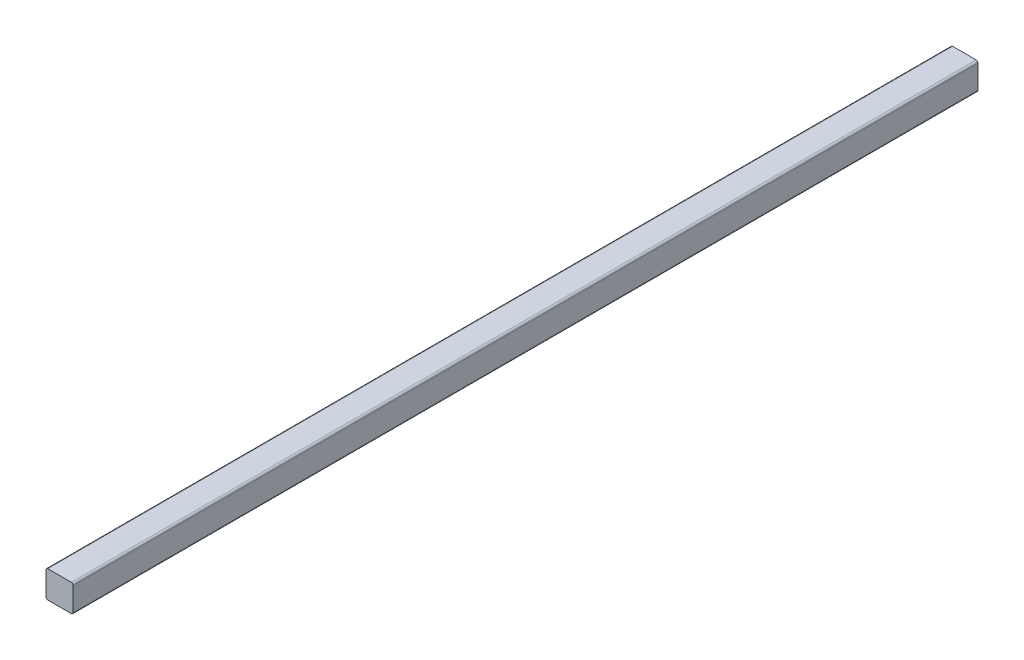
ISO-10303-21;
HEADER;
FILE_DESCRIPTION(('STEP AP214'),'2;1');
FILE_NAME('part.step','',(''),(''),'','','');
FILE_SCHEMA(('AUTOMOTIVE_DESIGN { 1 0 10303 214 1 1 1 1 }'));
ENDSEC;
DATA;
#1=APPLICATION_CONTEXT('core data for automotive mechanical design processes');
#2=APPLICATION_PROTOCOL_DEFINITION('international standard','automotive_design',2000,#1);
#3=PRODUCT_CONTEXT('',#1,'mechanical');
#4=PRODUCT('Part','Part','',(#3));
#5=PRODUCT_RELATED_PRODUCT_CATEGORY('part','',(#4));
#6=PRODUCT_DEFINITION_FORMATION('','',#4);
#7=PRODUCT_DEFINITION_CONTEXT('part definition',#1,'design');
#8=PRODUCT_DEFINITION('design','',#6,#7);
#9=PRODUCT_DEFINITION_SHAPE('','',#8);
#10=(LENGTH_UNIT() NAMED_UNIT(*) SI_UNIT(.MILLI.,.METRE.));
#11=(NAMED_UNIT(*) PLANE_ANGLE_UNIT() SI_UNIT($,.RADIAN.));
#12=(NAMED_UNIT(*) SI_UNIT($,.STERADIAN.) SOLID_ANGLE_UNIT());
#13=UNCERTAINTY_MEASURE_WITH_UNIT(LENGTH_MEASURE(1.E-05),#10,'distance_accuracy_value','');
#14=(GEOMETRIC_REPRESENTATION_CONTEXT(3) GLOBAL_UNCERTAINTY_ASSIGNED_CONTEXT((#13)) GLOBAL_UNIT_ASSIGNED_CONTEXT((#10,
#11,#12)) REPRESENTATION_CONTEXT('',''));
#15=CARTESIAN_POINT('',(0.,0.,0.));
#16=DIRECTION('',(0.,0.,1.));
#17=DIRECTION('',(1.,0.,0.));
#18=AXIS2_PLACEMENT_3D('',#15,#16,#17);
#19=CARTESIAN_POINT('',(2.,2.,1000.));
#20=DIRECTION('',(0.,0.,-1.));
#21=DIRECTION('',(-1.,0.,0.));
#22=AXIS2_PLACEMENT_3D('',#19,#20,#21);
#23=CYLINDRICAL_SURFACE('',#22,2.);
#24=CARTESIAN_POINT('',(2.,2.,0.));
#25=DIRECTION('',(0.,0.,1.));
#26=DIRECTION('',(-1.,0.,0.));
#27=AXIS2_PLACEMENT_3D('',#24,#25,#26);
#28=CIRCLE('',#27,2.);
#29=CARTESIAN_POINT('',(0.,2.00000000000001,0.));
#30=VERTEX_POINT('',#29);
#31=CARTESIAN_POINT('',(2.00000000000001,0.,0.));
#32=VERTEX_POINT('',#31);
#33=EDGE_CURVE('E129',#30,#32,#28,.T.);
#34=ORIENTED_EDGE('',*,*,#33,.T.);
#35=DIRECTION('',(0.,0.,-1.));
#36=VECTOR('',#35,1.);
#37=CARTESIAN_POINT('',(2.00000000000001,0.,1000.));
#38=LINE('',#37,#36);
#39=CARTESIAN_POINT('',(2.00000000000001,0.,1000.));
#40=VERTEX_POINT('',#39);
#41=EDGE_CURVE('E11',#40,#32,#38,.T.);
#42=ORIENTED_EDGE('',*,*,#41,.F.);
#43=CARTESIAN_POINT('',(2.,2.,1000.));
#44=DIRECTION('',(0.,0.,1.));
#45=DIRECTION('',(-1.,0.,0.));
#46=AXIS2_PLACEMENT_3D('',#43,#44,#45);
#47=CIRCLE('',#46,2.);
#48=CARTESIAN_POINT('',(0.,2.00000000000001,1000.));
#49=VERTEX_POINT('',#48);
#50=EDGE_CURVE('E143',#49,#40,#47,.T.);
#51=ORIENTED_EDGE('',*,*,#50,.F.);
#52=DIRECTION('',(0.,0.,-1.));
#53=VECTOR('',#52,1.);
#54=CARTESIAN_POINT('',(0.,2.00000000000001,1000.));
#55=LINE('',#54,#53);
#56=EDGE_CURVE('E125',#49,#30,#55,.T.);
#57=ORIENTED_EDGE('',*,*,#56,.T.);
#58=EDGE_LOOP('',(#34,#42,#51,#57));
#59=FACE_BOUND('',#58,.T.);
#60=ADVANCED_FACE('F33',(#59),#23,.T.);
#61=CARTESIAN_POINT('',(2.00000000000001,0.,1000.));
#62=DIRECTION('',(0.,1.,0.));
#63=DIRECTION('',(0.,0.,1.));
#64=AXIS2_PLACEMENT_3D('',#61,#62,#63);
#65=PLANE('',#64);
#66=DIRECTION('',(1.,0.,0.));
#67=VECTOR('',#66,1.);
#68=CARTESIAN_POINT('',(2.00000000000001,0.,0.));
#69=LINE('',#68,#67);
#70=CARTESIAN_POINT('',(28.,0.,0.));
#71=VERTEX_POINT('',#70);
#72=EDGE_CURVE('E132',#32,#71,#69,.T.);
#73=ORIENTED_EDGE('',*,*,#72,.T.);
#74=DIRECTION('',(0.,0.,-1.));
#75=VECTOR('',#74,1.);
#76=CARTESIAN_POINT('',(28.,0.,1000.));
#77=LINE('',#76,#75);
#78=CARTESIAN_POINT('',(28.,0.,1000.));
#79=VERTEX_POINT('',#78);
#80=EDGE_CURVE('E41',#79,#71,#77,.T.);
#81=ORIENTED_EDGE('',*,*,#80,.F.);
#82=DIRECTION('',(1.,0.,0.));
#83=VECTOR('',#82,1.);
#84=CARTESIAN_POINT('',(2.00000000000001,0.,1000.));
#85=LINE('',#84,#83);
#86=EDGE_CURVE('E92',#40,#79,#85,.T.);
#87=ORIENTED_EDGE('',*,*,#86,.F.);
#88=ORIENTED_EDGE('',*,*,#41,.T.);
#89=EDGE_LOOP('',(#73,#81,#87,#88));
#90=FACE_BOUND('',#89,.T.);
#91=ADVANCED_FACE('F178',(#90),#65,.F.);
#92=CARTESIAN_POINT('',(28.,2.,1000.));
#93=DIRECTION('',(0.,0.,-1.));
#94=DIRECTION('',(-1.,0.,0.));
#95=AXIS2_PLACEMENT_3D('',#92,#93,#94);
#96=CYLINDRICAL_SURFACE('',#95,2.);
#97=CARTESIAN_POINT('',(28.,2.,0.));
#98=DIRECTION('',(0.,0.,1.));
#99=DIRECTION('',(-1.,0.,0.));
#100=AXIS2_PLACEMENT_3D('',#97,#98,#99);
#101=CIRCLE('',#100,2.);
#102=CARTESIAN_POINT('',(30.,2.00000000000001,0.));
#103=VERTEX_POINT('',#102);
#104=EDGE_CURVE('E134',#71,#103,#101,.T.);
#105=ORIENTED_EDGE('',*,*,#104,.T.);
#106=DIRECTION('',(0.,0.,-1.));
#107=VECTOR('',#106,1.);
#108=CARTESIAN_POINT('',(30.,2.00000000000001,1000.));
#109=LINE('',#108,#107);
#110=CARTESIAN_POINT('',(30.,2.00000000000001,1000.));
#111=VERTEX_POINT('',#110);
#112=EDGE_CURVE('E150',#111,#103,#109,.T.);
#113=ORIENTED_EDGE('',*,*,#112,.F.);
#114=CARTESIAN_POINT('',(28.,2.,1000.));
#115=DIRECTION('',(0.,0.,1.));
#116=DIRECTION('',(-1.,0.,0.));
#117=AXIS2_PLACEMENT_3D('',#114,#115,#116);
#118=CIRCLE('',#117,2.);
#119=EDGE_CURVE('E158',#79,#111,#118,.T.);
#120=ORIENTED_EDGE('',*,*,#119,.F.);
#121=ORIENTED_EDGE('',*,*,#80,.T.);
#122=EDGE_LOOP('',(#105,#113,#120,#121));
#123=FACE_BOUND('',#122,.T.);
#124=ADVANCED_FACE('F156',(#123),#96,.T.);
#125=CARTESIAN_POINT('',(30.,2.00000000000001,1000.));
#126=DIRECTION('',(-1.,0.,0.));
#127=DIRECTION('',(0.,0.,1.));
#128=AXIS2_PLACEMENT_3D('',#125,#126,#127);
#129=PLANE('',#128);
#130=DIRECTION('',(0.,1.,0.));
#131=VECTOR('',#130,1.);
#132=CARTESIAN_POINT('',(30.,2.00000000000001,0.));
#133=LINE('',#132,#131);
#134=CARTESIAN_POINT('',(30.,28.,0.));
#135=VERTEX_POINT('',#134);
#136=EDGE_CURVE('E136',#103,#135,#133,.T.);
#137=ORIENTED_EDGE('',*,*,#136,.T.);
#138=DIRECTION('',(0.,0.,-1.));
#139=VECTOR('',#138,1.);
#140=CARTESIAN_POINT('',(30.,28.,1000.));
#141=LINE('',#140,#139);
#142=CARTESIAN_POINT('',(30.,28.,1000.));
#143=VERTEX_POINT('',#142);
#144=EDGE_CURVE('E147',#143,#135,#141,.T.);
#145=ORIENTED_EDGE('',*,*,#144,.F.);
#146=DIRECTION('',(0.,1.,0.));
#147=VECTOR('',#146,1.);
#148=CARTESIAN_POINT('',(30.,2.00000000000001,1000.));
#149=LINE('',#148,#147);
#150=EDGE_CURVE('E170',#111,#143,#149,.T.);
#151=ORIENTED_EDGE('',*,*,#150,.F.);
#152=ORIENTED_EDGE('',*,*,#112,.T.);
#153=EDGE_LOOP('',(#137,#145,#151,#152));
#154=FACE_BOUND('',#153,.T.);
#155=ADVANCED_FACE('F166',(#154),#129,.F.);
#156=CARTESIAN_POINT('',(28.,28.,1000.));
#157=DIRECTION('',(0.,0.,-1.));
#158=DIRECTION('',(-1.,0.,0.));
#159=AXIS2_PLACEMENT_3D('',#156,#157,#158);
#160=CYLINDRICAL_SURFACE('',#159,2.);
#161=CARTESIAN_POINT('',(28.,28.,0.));
#162=DIRECTION('',(0.,0.,1.));
#163=DIRECTION('',(-1.,0.,0.));
#164=AXIS2_PLACEMENT_3D('',#161,#162,#163);
#165=CIRCLE('',#164,2.);
#166=CARTESIAN_POINT('',(28.,30.,0.));
#167=VERTEX_POINT('',#166);
#168=EDGE_CURVE('E138',#135,#167,#165,.T.);
#169=ORIENTED_EDGE('',*,*,#168,.T.);
#170=DIRECTION('',(0.,0.,-1.));
#171=VECTOR('',#170,1.);
#172=CARTESIAN_POINT('',(28.,30.,1000.));
#173=LINE('',#172,#171);
#174=CARTESIAN_POINT('',(28.,30.,1000.));
#175=VERTEX_POINT('',#174);
#176=EDGE_CURVE('E120',#175,#167,#173,.T.);
#177=ORIENTED_EDGE('',*,*,#176,.F.);
#178=CARTESIAN_POINT('',(28.,28.,1000.));
#179=DIRECTION('',(0.,0.,1.));
#180=DIRECTION('',(-1.,0.,0.));
#181=AXIS2_PLACEMENT_3D('',#178,#179,#180);
#182=CIRCLE('',#181,2.);
#183=EDGE_CURVE('E111',#143,#175,#182,.T.);
#184=ORIENTED_EDGE('',*,*,#183,.F.);
#185=ORIENTED_EDGE('',*,*,#144,.T.);
#186=EDGE_LOOP('',(#169,#177,#184,#185));
#187=FACE_BOUND('',#186,.T.);
#188=ADVANCED_FACE('F169',(#187),#160,.T.);
#189=CARTESIAN_POINT('',(28.,30.,1000.));
#190=DIRECTION('',(0.,-1.,0.));
#191=DIRECTION('',(0.,0.,-1.));
#192=AXIS2_PLACEMENT_3D('',#189,#190,#191);
#193=PLANE('',#192);
#194=DIRECTION('',(-1.,0.,0.));
#195=VECTOR('',#194,1.);
#196=CARTESIAN_POINT('',(28.,30.,0.));
#197=LINE('',#196,#195);
#198=CARTESIAN_POINT('',(2.00000000000001,30.,0.));
#199=VERTEX_POINT('',#198);
#200=EDGE_CURVE('E119',#167,#199,#197,.T.);
#201=ORIENTED_EDGE('',*,*,#200,.T.);
#202=DIRECTION('',(0.,0.,-1.));
#203=VECTOR('',#202,1.);
#204=CARTESIAN_POINT('',(2.00000000000001,30.,1000.));
#205=LINE('',#204,#203);
#206=CARTESIAN_POINT('',(2.00000000000001,30.,1000.));
#207=VERTEX_POINT('',#206);
#208=EDGE_CURVE('E116',#207,#199,#205,.T.);
#209=ORIENTED_EDGE('',*,*,#208,.F.);
#210=DIRECTION('',(-1.,0.,0.));
#211=VECTOR('',#210,1.);
#212=CARTESIAN_POINT('',(28.,30.,1000.));
#213=LINE('',#212,#211);
#214=EDGE_CURVE('E105',#175,#207,#213,.T.);
#215=ORIENTED_EDGE('',*,*,#214,.F.);
#216=ORIENTED_EDGE('',*,*,#176,.T.);
#217=EDGE_LOOP('',(#201,#209,#215,#216));
#218=FACE_BOUND('',#217,.T.);
#219=ADVANCED_FACE('F117',(#218),#193,.F.);
#220=CARTESIAN_POINT('',(2.,28.,1000.));
#221=DIRECTION('',(0.,0.,-1.));
#222=DIRECTION('',(-1.,0.,0.));
#223=AXIS2_PLACEMENT_3D('',#220,#221,#222);
#224=CYLINDRICAL_SURFACE('',#223,2.);
#225=CARTESIAN_POINT('',(2.,28.,0.));
#226=DIRECTION('',(0.,0.,1.));
#227=DIRECTION('',(-1.,0.,0.));
#228=AXIS2_PLACEMENT_3D('',#225,#226,#227);
#229=CIRCLE('',#228,2.);
#230=CARTESIAN_POINT('',(0.,28.,0.));
#231=VERTEX_POINT('',#230);
#232=EDGE_CURVE('E78',#199,#231,#229,.T.);
#233=ORIENTED_EDGE('',*,*,#232,.T.);
#234=DIRECTION('',(0.,0.,-1.));
#235=VECTOR('',#234,1.);
#236=CARTESIAN_POINT('',(0.,28.,1000.));
#237=LINE('',#236,#235);
#238=CARTESIAN_POINT('',(0.,28.,1000.));
#239=VERTEX_POINT('',#238);
#240=EDGE_CURVE('E121',#239,#231,#237,.T.);
#241=ORIENTED_EDGE('',*,*,#240,.F.);
#242=CARTESIAN_POINT('',(2.,28.,1000.));
#243=DIRECTION('',(0.,0.,1.));
#244=DIRECTION('',(-1.,0.,0.));
#245=AXIS2_PLACEMENT_3D('',#242,#243,#244);
#246=CIRCLE('',#245,2.);
#247=EDGE_CURVE('E109',#207,#239,#246,.T.);
#248=ORIENTED_EDGE('',*,*,#247,.F.);
#249=ORIENTED_EDGE('',*,*,#208,.T.);
#250=EDGE_LOOP('',(#233,#241,#248,#249));
#251=FACE_BOUND('',#250,.T.);
#252=ADVANCED_FACE('F123',(#251),#224,.T.);
#253=CARTESIAN_POINT('',(0.,28.,1000.));
#254=DIRECTION('',(1.,0.,0.));
#255=DIRECTION('',(0.,0.,-1.));
#256=AXIS2_PLACEMENT_3D('',#253,#254,#255);
#257=PLANE('',#256);
#258=DIRECTION('',(0.,-1.,0.));
#259=VECTOR('',#258,1.);
#260=CARTESIAN_POINT('',(0.,28.,0.));
#261=LINE('',#260,#259);
#262=EDGE_CURVE('E84',#231,#30,#261,.T.);
#263=ORIENTED_EDGE('',*,*,#262,.T.);
#264=ORIENTED_EDGE('',*,*,#56,.F.);
#265=DIRECTION('',(0.,-1.,0.));
#266=VECTOR('',#265,1.);
#267=CARTESIAN_POINT('',(0.,28.,1000.));
#268=LINE('',#267,#266);
#269=EDGE_CURVE('E49',#239,#49,#268,.T.);
#270=ORIENTED_EDGE('',*,*,#269,.F.);
#271=ORIENTED_EDGE('',*,*,#240,.T.);
#272=EDGE_LOOP('',(#263,#264,#270,#271));
#273=FACE_BOUND('',#272,.T.);
#274=ADVANCED_FACE('F194',(#273),#257,.F.);
#275=CARTESIAN_POINT('',(2.,2.,1000.));
#276=DIRECTION('',(0.,0.,-1.));
#277=DIRECTION('',(-1.,0.,0.));
#278=AXIS2_PLACEMENT_3D('',#275,#276,#277);
#279=PLANE('',#278);
#280=ORIENTED_EDGE('',*,*,#50,.T.);
#281=ORIENTED_EDGE('',*,*,#86,.T.);
#282=ORIENTED_EDGE('',*,*,#119,.T.);
#283=ORIENTED_EDGE('',*,*,#150,.T.);
#284=ORIENTED_EDGE('',*,*,#183,.T.);
#285=ORIENTED_EDGE('',*,*,#214,.T.);
#286=ORIENTED_EDGE('',*,*,#247,.T.);
#287=ORIENTED_EDGE('',*,*,#269,.T.);
#288=EDGE_LOOP('',(#280,#281,#282,#283,#284,#285,#286,#287));
#289=FACE_BOUND('',#288,.T.);
#290=ADVANCED_FACE('F107',(#289),#279,.F.);
#291=CARTESIAN_POINT('',(2.,2.,0.));
#292=DIRECTION('',(0.,0.,-1.));
#293=DIRECTION('',(-1.,0.,0.));
#294=AXIS2_PLACEMENT_3D('',#291,#292,#293);
#295=PLANE('',#294);
#296=ORIENTED_EDGE('',*,*,#33,.F.);
#297=ORIENTED_EDGE('',*,*,#262,.F.);
#298=ORIENTED_EDGE('',*,*,#232,.F.);
#299=ORIENTED_EDGE('',*,*,#200,.F.);
#300=ORIENTED_EDGE('',*,*,#168,.F.);
#301=ORIENTED_EDGE('',*,*,#136,.F.);
#302=ORIENTED_EDGE('',*,*,#104,.F.);
#303=ORIENTED_EDGE('',*,*,#72,.F.);
#304=EDGE_LOOP('',(#296,#297,#298,#299,#300,#301,#302,#303));
#305=FACE_BOUND('',#304,.T.);
#306=ADVANCED_FACE('F162',(#305),#295,.T.);
#307=CLOSED_SHELL('',(#60,#91,#124,#155,#188,#219,#252,#274,#290,#306));
#308=MANIFOLD_SOLID_BREP('B2',#307);
#309=ADVANCED_BREP_SHAPE_REPRESENTATION('',(#18,#308),#14);
#310=SHAPE_DEFINITION_REPRESENTATION(#9,#309);
ENDSEC;
END-ISO-10303-21;
